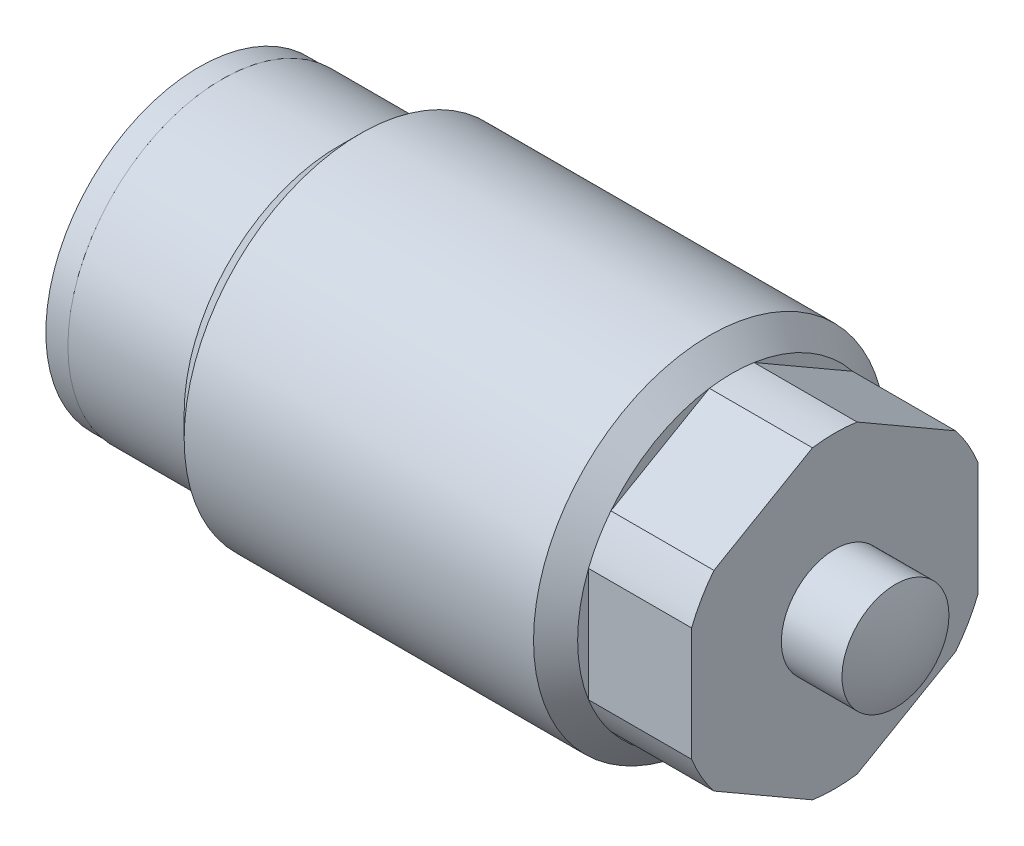
ISO-10303-21;
HEADER;
FILE_DESCRIPTION(('STEP AP214'),'2;1');
FILE_NAME('part.step','',(''),(''),'','','');
FILE_SCHEMA(('AUTOMOTIVE_DESIGN { 1 0 10303 214 1 1 1 1 }'));
ENDSEC;
DATA;
#1=APPLICATION_CONTEXT('core data for automotive mechanical design processes');
#2=APPLICATION_PROTOCOL_DEFINITION('international standard','automotive_design',2000,#1);
#3=PRODUCT_CONTEXT('',#1,'mechanical');
#4=PRODUCT('Part','Part','',(#3));
#5=PRODUCT_RELATED_PRODUCT_CATEGORY('part','',(#4));
#6=PRODUCT_DEFINITION_FORMATION('','',#4);
#7=PRODUCT_DEFINITION_CONTEXT('part definition',#1,'design');
#8=PRODUCT_DEFINITION('design','',#6,#7);
#9=PRODUCT_DEFINITION_SHAPE('','',#8);
#10=(LENGTH_UNIT() NAMED_UNIT(*) SI_UNIT(.MILLI.,.METRE.));
#11=(NAMED_UNIT(*) PLANE_ANGLE_UNIT() SI_UNIT($,.RADIAN.));
#12=(NAMED_UNIT(*) SI_UNIT($,.STERADIAN.) SOLID_ANGLE_UNIT());
#13=UNCERTAINTY_MEASURE_WITH_UNIT(LENGTH_MEASURE(1.E-05),#10,'distance_accuracy_value','');
#14=(GEOMETRIC_REPRESENTATION_CONTEXT(3) GLOBAL_UNCERTAINTY_ASSIGNED_CONTEXT((#13)) GLOBAL_UNIT_ASSIGNED_CONTEXT((#10,
#11,#12)) REPRESENTATION_CONTEXT('',''));
#15=CARTESIAN_POINT('',(0.,0.,0.));
#16=DIRECTION('',(0.,0.,1.));
#17=DIRECTION('',(1.,0.,0.));
#18=AXIS2_PLACEMENT_3D('',#15,#16,#17);
#19=CARTESIAN_POINT('',(22.606,7.8105,0.));
#20=DIRECTION('',(1.,0.,0.));
#21=DIRECTION('',(0.,0.,-1.));
#22=AXIS2_PLACEMENT_3D('',#19,#20,#21);
#23=PLANE('',#22);
#24=DIRECTION('',(0.,-0.5,-0.866025403784439));
#25=VECTOR('',#24,1.);
#26=CARTESIAN_POINT('',(22.606,-3.66617420935412,6.35));
#27=LINE('',#26,#25);
#28=CARTESIAN_POINT('',(22.606,-4.23811870115982,5.35936308108337));
#29=VERTEX_POINT('',#28);
#30=CARTESIAN_POINT('',(22.606,-6.76040392690255,0.990636918916635));
#31=VERTEX_POINT('',#30);
#32=EDGE_CURVE('E196',#29,#31,#27,.T.);
#33=ORIENTED_EDGE('',*,*,#32,.F.);
#34=CARTESIAN_POINT('',(22.606,0.,0.));
#35=DIRECTION('',(1.,0.,0.));
#36=DIRECTION('',(0.,0.,-1.));
#37=AXIS2_PLACEMENT_3D('',#34,#35,#36);
#38=CIRCLE('',#37,6.8326);
#39=EDGE_CURVE('E12',#29,#31,#38,.T.);
#40=ORIENTED_EDGE('',*,*,#39,.T.);
#41=EDGE_LOOP('',(#33,#40));
#42=FACE_BOUND('',#41,.T.);
#43=ADVANCED_FACE('F41',(#42),#23,.T.);
#44=DIRECTION('',(0.,0.5,-0.866025403784439));
#45=VECTOR('',#44,1.);
#46=CARTESIAN_POINT('',(22.606,-7.33234841870825,0.));
#47=LINE('',#46,#45);
#48=CARTESIAN_POINT('',(22.606,-6.76040392690255,-0.990636918916635));
#49=VERTEX_POINT('',#48);
#50=CARTESIAN_POINT('',(22.606,-4.23811870115983,-5.35936308108337));
#51=VERTEX_POINT('',#50);
#52=EDGE_CURVE('E194',#49,#51,#47,.T.);
#53=ORIENTED_EDGE('',*,*,#52,.F.);
#54=CARTESIAN_POINT('',(22.606,0.,0.));
#55=DIRECTION('',(1.,0.,0.));
#56=DIRECTION('',(0.,0.,-1.));
#57=AXIS2_PLACEMENT_3D('',#54,#55,#56);
#58=CIRCLE('',#57,6.8326);
#59=EDGE_CURVE('E49',#49,#51,#58,.T.);
#60=ORIENTED_EDGE('',*,*,#59,.T.);
#61=EDGE_LOOP('',(#53,#60));
#62=FACE_BOUND('',#61,.T.);
#63=ADVANCED_FACE('F271',(#62),#23,.T.);
#64=DIRECTION('',(0.,1.,0.));
#65=VECTOR('',#64,1.);
#66=CARTESIAN_POINT('',(22.606,-3.66617420935412,-6.35));
#67=LINE('',#66,#65);
#68=CARTESIAN_POINT('',(22.606,-2.52228522574272,-6.35));
#69=VERTEX_POINT('',#68);
#70=CARTESIAN_POINT('',(22.606,2.52228522574272,-6.35));
#71=VERTEX_POINT('',#70);
#72=EDGE_CURVE('E150',#69,#71,#67,.T.);
#73=ORIENTED_EDGE('',*,*,#72,.F.);
#74=CARTESIAN_POINT('',(22.606,0.,0.));
#75=DIRECTION('',(1.,0.,0.));
#76=DIRECTION('',(0.,0.,-1.));
#77=AXIS2_PLACEMENT_3D('',#74,#75,#76);
#78=CIRCLE('',#77,6.8326);
#79=EDGE_CURVE('E159',#69,#71,#78,.T.);
#80=ORIENTED_EDGE('',*,*,#79,.T.);
#81=EDGE_LOOP('',(#73,#80));
#82=FACE_BOUND('',#81,.T.);
#83=ADVANCED_FACE('F158',(#82),#23,.T.);
#84=DIRECTION('',(0.,0.5,0.866025403784439));
#85=VECTOR('',#84,1.);
#86=CARTESIAN_POINT('',(22.606,3.66617420935412,-6.35));
#87=LINE('',#86,#85);
#88=CARTESIAN_POINT('',(22.606,4.23811870115983,-5.35936308108337));
#89=VERTEX_POINT('',#88);
#90=CARTESIAN_POINT('',(22.606,6.76040392690255,-0.990636918916637));
#91=VERTEX_POINT('',#90);
#92=EDGE_CURVE('E161',#89,#91,#87,.T.);
#93=ORIENTED_EDGE('',*,*,#92,.F.);
#94=CARTESIAN_POINT('',(22.606,0.,0.));
#95=DIRECTION('',(1.,0.,0.));
#96=DIRECTION('',(0.,0.,-1.));
#97=AXIS2_PLACEMENT_3D('',#94,#95,#96);
#98=CIRCLE('',#97,6.8326);
#99=EDGE_CURVE('E166',#89,#91,#98,.T.);
#100=ORIENTED_EDGE('',*,*,#99,.T.);
#101=EDGE_LOOP('',(#93,#100));
#102=FACE_BOUND('',#101,.T.);
#103=ADVANCED_FACE('F278',(#102),#23,.T.);
#104=DIRECTION('',(0.,-0.5,0.866025403784439));
#105=VECTOR('',#104,1.);
#106=CARTESIAN_POINT('',(22.606,7.33234841870825,0.));
#107=LINE('',#106,#105);
#108=CARTESIAN_POINT('',(22.606,6.76040392690255,0.99063691891664));
#109=VERTEX_POINT('',#108);
#110=CARTESIAN_POINT('',(22.606,4.23811870115983,5.35936308108336));
#111=VERTEX_POINT('',#110);
#112=EDGE_CURVE('E202',#109,#111,#107,.T.);
#113=ORIENTED_EDGE('',*,*,#112,.F.);
#114=CARTESIAN_POINT('',(22.606,0.,0.));
#115=DIRECTION('',(1.,0.,0.));
#116=DIRECTION('',(0.,0.,-1.));
#117=AXIS2_PLACEMENT_3D('',#114,#115,#116);
#118=CIRCLE('',#117,6.8326);
#119=EDGE_CURVE('E168',#109,#111,#118,.T.);
#120=ORIENTED_EDGE('',*,*,#119,.T.);
#121=EDGE_LOOP('',(#113,#120));
#122=FACE_BOUND('',#121,.T.);
#123=ADVANCED_FACE('F286',(#122),#23,.T.);
#124=CARTESIAN_POINT('',(27.178,-3.66617420935412,-6.35));
#125=DIRECTION('',(0.,0.,1.));
#126=DIRECTION('',(1.,0.,0.));
#127=AXIS2_PLACEMENT_3D('',#124,#125,#126);
#128=PLANE('',#127);
#129=DIRECTION('',(1.,0.,0.));
#130=VECTOR('',#129,1.);
#131=CARTESIAN_POINT('',(0.51456994216988,-2.52228522574272,-6.35));
#132=LINE('',#131,#130);
#133=CARTESIAN_POINT('',(27.178,-2.52228522574272,-6.35));
#134=VERTEX_POINT('',#133);
#135=EDGE_CURVE('E133',#69,#134,#132,.T.);
#136=ORIENTED_EDGE('',*,*,#135,.F.);
#137=ORIENTED_EDGE('',*,*,#72,.T.);
#138=DIRECTION('',(1.,0.,0.));
#139=VECTOR('',#138,1.);
#140=CARTESIAN_POINT('',(0.51456994216988,2.52228522574272,-6.35));
#141=LINE('',#140,#139);
#142=CARTESIAN_POINT('',(27.178,2.52228522574272,-6.35));
#143=VERTEX_POINT('',#142);
#144=EDGE_CURVE('E155',#143,#71,#141,.F.);
#145=ORIENTED_EDGE('',*,*,#144,.F.);
#146=DIRECTION('',(0.,1.,0.));
#147=VECTOR('',#146,1.);
#148=CARTESIAN_POINT('',(27.178,-3.66617420935412,-6.35));
#149=LINE('',#148,#147);
#150=EDGE_CURVE('E153',#134,#143,#149,.T.);
#151=ORIENTED_EDGE('',*,*,#150,.F.);
#152=EDGE_LOOP('',(#136,#137,#145,#151));
#153=FACE_BOUND('',#152,.T.);
#154=ADVANCED_FACE('F148',(#153),#128,.F.);
#155=CARTESIAN_POINT('',(27.178,3.66617420935412,-6.35));
#156=DIRECTION('',(0.,-0.866025403784438,0.5));
#157=DIRECTION('',(0.,-0.5,-0.866025403784439));
#158=AXIS2_PLACEMENT_3D('',#155,#156,#157);
#159=PLANE('',#158);
#160=DIRECTION('',(1.,0.,0.));
#161=VECTOR('',#160,1.);
#162=CARTESIAN_POINT('',(0.51456994216988,4.23811870115982,-5.35936308108337));
#163=LINE('',#162,#161);
#164=CARTESIAN_POINT('',(27.178,4.23811870115982,-5.35936308108337));
#165=VERTEX_POINT('',#164);
#166=EDGE_CURVE('E230',#89,#165,#163,.T.);
#167=ORIENTED_EDGE('',*,*,#166,.F.);
#168=ORIENTED_EDGE('',*,*,#92,.T.);
#169=DIRECTION('',(1.,0.,0.));
#170=VECTOR('',#169,1.);
#171=CARTESIAN_POINT('',(0.51456994216988,6.76040392690255,-0.990636918916636));
#172=LINE('',#171,#170);
#173=CARTESIAN_POINT('',(27.178,6.76040392690255,-0.990636918916636));
#174=VERTEX_POINT('',#173);
#175=EDGE_CURVE('E232',#174,#91,#172,.F.);
#176=ORIENTED_EDGE('',*,*,#175,.F.);
#177=DIRECTION('',(0.,0.5,0.866025403784439));
#178=VECTOR('',#177,1.);
#179=CARTESIAN_POINT('',(27.178,3.66617420935412,-6.35));
#180=LINE('',#179,#178);
#181=EDGE_CURVE('E218',#165,#174,#180,.T.);
#182=ORIENTED_EDGE('',*,*,#181,.F.);
#183=EDGE_LOOP('',(#167,#168,#176,#182));
#184=FACE_BOUND('',#183,.T.);
#185=ADVANCED_FACE('F316',(#184),#159,.F.);
#186=CARTESIAN_POINT('',(27.178,7.33234841870825,0.));
#187=DIRECTION('',(0.,-0.866025403784439,-0.5));
#188=DIRECTION('',(0.,0.5,-0.866025403784439));
#189=AXIS2_PLACEMENT_3D('',#186,#187,#188);
#190=PLANE('',#189);
#191=DIRECTION('',(1.,0.,0.));
#192=VECTOR('',#191,1.);
#193=CARTESIAN_POINT('',(0.51456994216988,6.76040392690255,0.990636918916643));
#194=LINE('',#193,#192);
#195=CARTESIAN_POINT('',(27.178,6.76040392690255,0.990636918916636));
#196=VERTEX_POINT('',#195);
#197=EDGE_CURVE('E235',#109,#196,#194,.T.);
#198=ORIENTED_EDGE('',*,*,#197,.F.);
#199=ORIENTED_EDGE('',*,*,#112,.T.);
#200=DIRECTION('',(1.,0.,0.));
#201=VECTOR('',#200,1.);
#202=CARTESIAN_POINT('',(0.51456994216988,4.23811870115983,5.35936308108336));
#203=LINE('',#202,#201);
#204=CARTESIAN_POINT('',(27.178,4.23811870115983,5.35936308108336));
#205=VERTEX_POINT('',#204);
#206=EDGE_CURVE('E237',#205,#111,#203,.F.);
#207=ORIENTED_EDGE('',*,*,#206,.F.);
#208=DIRECTION('',(0.,-0.5,0.866025403784439));
#209=VECTOR('',#208,1.);
#210=CARTESIAN_POINT('',(27.178,7.33234841870825,0.));
#211=LINE('',#210,#209);
#212=EDGE_CURVE('E215',#196,#205,#211,.T.);
#213=ORIENTED_EDGE('',*,*,#212,.F.);
#214=EDGE_LOOP('',(#198,#199,#207,#213));
#215=FACE_BOUND('',#214,.T.);
#216=ADVANCED_FACE('F319',(#215),#190,.F.);
#217=CARTESIAN_POINT('',(27.178,3.66617420935413,6.35));
#218=DIRECTION('',(0.,0.,-1.));
#219=DIRECTION('',(-1.,0.,0.));
#220=AXIS2_PLACEMENT_3D('',#217,#218,#219);
#221=PLANE('',#220);
#222=DIRECTION('',(1.,0.,0.));
#223=VECTOR('',#222,1.);
#224=CARTESIAN_POINT('',(0.51456994216988,2.52228522574272,6.35));
#225=LINE('',#224,#223);
#226=CARTESIAN_POINT('',(22.606,2.52228522574272,6.35));
#227=VERTEX_POINT('',#226);
#228=CARTESIAN_POINT('',(27.178,2.52228522574272,6.35));
#229=VERTEX_POINT('',#228);
#230=EDGE_CURVE('E240',#227,#229,#225,.T.);
#231=ORIENTED_EDGE('',*,*,#230,.F.);
#232=DIRECTION('',(0.,-1.,0.));
#233=VECTOR('',#232,1.);
#234=CARTESIAN_POINT('',(22.606,3.66617420935413,6.35));
#235=LINE('',#234,#233);
#236=CARTESIAN_POINT('',(22.606,-2.52228522574272,6.35));
#237=VERTEX_POINT('',#236);
#238=EDGE_CURVE('E199',#227,#237,#235,.T.);
#239=ORIENTED_EDGE('',*,*,#238,.T.);
#240=DIRECTION('',(1.,0.,0.));
#241=VECTOR('',#240,1.);
#242=CARTESIAN_POINT('',(0.51456994216988,-2.52228522574272,6.35));
#243=LINE('',#242,#241);
#244=CARTESIAN_POINT('',(27.178,-2.52228522574272,6.35));
#245=VERTEX_POINT('',#244);
#246=EDGE_CURVE('E242',#245,#237,#243,.F.);
#247=ORIENTED_EDGE('',*,*,#246,.F.);
#248=DIRECTION('',(0.,-1.,0.));
#249=VECTOR('',#248,1.);
#250=CARTESIAN_POINT('',(27.178,3.66617420935413,6.35));
#251=LINE('',#250,#249);
#252=EDGE_CURVE('E212',#229,#245,#251,.T.);
#253=ORIENTED_EDGE('',*,*,#252,.F.);
#254=EDGE_LOOP('',(#231,#239,#247,#253));
#255=FACE_BOUND('',#254,.T.);
#256=ADVANCED_FACE('F323',(#255),#221,.F.);
#257=CARTESIAN_POINT('',(27.178,-3.66617420935412,6.35));
#258=DIRECTION('',(0.,0.866025403784439,-0.5));
#259=DIRECTION('',(0.,0.5,0.866025403784439));
#260=AXIS2_PLACEMENT_3D('',#257,#258,#259);
#261=PLANE('',#260);
#262=DIRECTION('',(1.,0.,0.));
#263=VECTOR('',#262,1.);
#264=CARTESIAN_POINT('',(0.51456994216988,-4.23811870115983,5.35936308108336));
#265=LINE('',#264,#263);
#266=CARTESIAN_POINT('',(27.178,-4.23811870115982,5.35936308108337));
#267=VERTEX_POINT('',#266);
#268=EDGE_CURVE('E64',#29,#267,#265,.T.);
#269=ORIENTED_EDGE('',*,*,#268,.F.);
#270=ORIENTED_EDGE('',*,*,#32,.T.);
#271=DIRECTION('',(1.,0.,0.));
#272=VECTOR('',#271,1.);
#273=CARTESIAN_POINT('',(0.51456994216988,-6.76040392690255,0.990636918916641));
#274=LINE('',#273,#272);
#275=CARTESIAN_POINT('',(27.178,-6.76040392690255,0.990636918916635));
#276=VERTEX_POINT('',#275);
#277=EDGE_CURVE('E246',#276,#31,#274,.F.);
#278=ORIENTED_EDGE('',*,*,#277,.F.);
#279=DIRECTION('',(0.,-0.5,-0.866025403784439));
#280=VECTOR('',#279,1.);
#281=CARTESIAN_POINT('',(27.178,-3.66617420935412,6.35));
#282=LINE('',#281,#280);
#283=EDGE_CURVE('E209',#267,#276,#282,.T.);
#284=ORIENTED_EDGE('',*,*,#283,.F.);
#285=EDGE_LOOP('',(#269,#270,#278,#284));
#286=FACE_BOUND('',#285,.T.);
#287=ADVANCED_FACE('F327',(#286),#261,.F.);
#288=CARTESIAN_POINT('',(27.178,-7.33234841870825,0.));
#289=DIRECTION('',(0.,0.866025403784439,0.5));
#290=DIRECTION('',(0.,-0.5,0.866025403784439));
#291=AXIS2_PLACEMENT_3D('',#288,#289,#290);
#292=PLANE('',#291);
#293=DIRECTION('',(1.,0.,0.));
#294=VECTOR('',#293,1.);
#295=CARTESIAN_POINT('',(0.51456994216988,-6.76040392690255,-0.990636918916637));
#296=LINE('',#295,#294);
#297=CARTESIAN_POINT('',(27.178,-6.76040392690255,-0.99063691891663));
#298=VERTEX_POINT('',#297);
#299=EDGE_CURVE('E56',#49,#298,#296,.T.);
#300=ORIENTED_EDGE('',*,*,#299,.F.);
#301=ORIENTED_EDGE('',*,*,#52,.T.);
#302=DIRECTION('',(1.,0.,0.));
#303=VECTOR('',#302,1.);
#304=CARTESIAN_POINT('',(0.51456994216988,-4.23811870115983,-5.35936308108336));
#305=LINE('',#304,#303);
#306=CARTESIAN_POINT('',(27.178,-4.23811870115982,-5.35936308108337));
#307=VERTEX_POINT('',#306);
#308=EDGE_CURVE('E136',#307,#51,#305,.F.);
#309=ORIENTED_EDGE('',*,*,#308,.F.);
#310=DIRECTION('',(0.,0.5,-0.866025403784439));
#311=VECTOR('',#310,1.);
#312=CARTESIAN_POINT('',(27.178,-7.33234841870825,0.));
#313=LINE('',#312,#311);
#314=EDGE_CURVE('E193',#298,#307,#313,.T.);
#315=ORIENTED_EDGE('',*,*,#314,.F.);
#316=EDGE_LOOP('',(#300,#301,#309,#315));
#317=FACE_BOUND('',#316,.T.);
#318=ADVANCED_FACE('F269',(#317),#292,.F.);
#319=CARTESIAN_POINT('',(27.178,10.9985226280624,-6.35));
#320=DIRECTION('',(1.,0.,0.));
#321=DIRECTION('',(0.,0.,-1.));
#322=AXIS2_PLACEMENT_3D('',#319,#320,#321);
#323=PLANE('',#322);
#324=CARTESIAN_POINT('',(27.178,0.,0.));
#325=DIRECTION('',(1.,0.,0.));
#326=DIRECTION('',(0.,0.,-1.));
#327=AXIS2_PLACEMENT_3D('',#324,#325,#326);
#328=CIRCLE('',#327,2.37109);
#329=CARTESIAN_POINT('',(27.178,0.,-2.37109));
#330=VERTEX_POINT('',#329);
#331=EDGE_CURVE('E181',#330,#330,#328,.T.);
#332=ORIENTED_EDGE('',*,*,#331,.F.);
#333=EDGE_LOOP('',(#332));
#334=FACE_BOUND('',#333,.T.);
#335=ORIENTED_EDGE('',*,*,#150,.T.);
#336=CARTESIAN_POINT('',(27.178,0.,0.));
#337=DIRECTION('',(1.,0.,0.));
#338=DIRECTION('',(0.,0.,-1.));
#339=AXIS2_PLACEMENT_3D('',#336,#337,#338);
#340=CIRCLE('',#339,6.8326);
#341=EDGE_CURVE('E251',#143,#165,#340,.T.);
#342=ORIENTED_EDGE('',*,*,#341,.T.);
#343=ORIENTED_EDGE('',*,*,#181,.T.);
#344=CARTESIAN_POINT('',(27.178,0.,0.));
#345=DIRECTION('',(1.,0.,0.));
#346=DIRECTION('',(0.,0.,-1.));
#347=AXIS2_PLACEMENT_3D('',#344,#345,#346);
#348=CIRCLE('',#347,6.8326);
#349=EDGE_CURVE('E177',#174,#196,#348,.T.);
#350=ORIENTED_EDGE('',*,*,#349,.T.);
#351=ORIENTED_EDGE('',*,*,#212,.T.);
#352=EDGE_CURVE('E370',#205,#229,#348,.T.);
#353=ORIENTED_EDGE('',*,*,#352,.T.);
#354=ORIENTED_EDGE('',*,*,#252,.T.);
#355=EDGE_CURVE('E369',#245,#267,#348,.T.);
#356=ORIENTED_EDGE('',*,*,#355,.T.);
#357=ORIENTED_EDGE('',*,*,#283,.T.);
#358=EDGE_CURVE('E180',#276,#298,#348,.T.);
#359=ORIENTED_EDGE('',*,*,#358,.T.);
#360=ORIENTED_EDGE('',*,*,#314,.T.);
#361=EDGE_CURVE('E178',#307,#134,#348,.T.);
#362=ORIENTED_EDGE('',*,*,#361,.T.);
#363=EDGE_LOOP('',(#335,#342,#343,#350,#351,#353,#354,#356,#357,#359,#360,#362));
#364=FACE_BOUND('',#363,.T.);
#365=ADVANCED_FACE('F284',(#334,#364),#323,.T.);
#366=ORIENTED_EDGE('',*,*,#238,.F.);
#367=CARTESIAN_POINT('',(22.606,0.,0.));
#368=DIRECTION('',(1.,0.,0.));
#369=DIRECTION('',(0.,0.,-1.));
#370=AXIS2_PLACEMENT_3D('',#367,#368,#369);
#371=CIRCLE('',#370,6.8326);
#372=EDGE_CURVE('E172',#227,#237,#371,.T.);
#373=ORIENTED_EDGE('',*,*,#372,.T.);
#374=EDGE_LOOP('',(#366,#373));
#375=FACE_BOUND('',#374,.T.);
#376=ADVANCED_FACE('F280',(#375),#23,.T.);
#377=CARTESIAN_POINT('',(30.6025425410263,0.,0.));
#378=DIRECTION('',(-1.,0.,0.));
#379=DIRECTION('',(0.,0.,1.));
#380=AXIS2_PLACEMENT_3D('',#377,#378,#379);
#381=CYLINDRICAL_SURFACE('',#380,7.8105);
#382=CARTESIAN_POINT('',(21.6281,0.,0.));
#383=DIRECTION('',(1.,0.,0.));
#384=DIRECTION('',(0.,0.,-1.));
#385=AXIS2_PLACEMENT_3D('',#382,#383,#384);
#386=CIRCLE('',#385,7.8105);
#387=CARTESIAN_POINT('',(21.6281,0.,-7.8105));
#388=VERTEX_POINT('',#387);
#389=EDGE_CURVE('E174',#388,#388,#386,.F.);
#390=ORIENTED_EDGE('',*,*,#389,.T.);
#391=EDGE_LOOP('',(#390));
#392=FACE_BOUND('',#391,.T.);
#393=CARTESIAN_POINT('',(6.13409999999999,0.,0.));
#394=DIRECTION('',(-1.,0.,0.));
#395=DIRECTION('',(0.,0.,1.));
#396=AXIS2_PLACEMENT_3D('',#393,#394,#395);
#397=CIRCLE('',#396,7.8105);
#398=CARTESIAN_POINT('',(6.13409999999999,0.,7.8105));
#399=VERTEX_POINT('',#398);
#400=EDGE_CURVE('E190',#399,#399,#397,.T.);
#401=ORIENTED_EDGE('',*,*,#400,.F.);
#402=EDGE_LOOP('',(#401));
#403=FACE_BOUND('',#402,.T.);
#404=ADVANCED_FACE('F283',(#392,#403),#381,.T.);
#405=CARTESIAN_POINT('',(0.,0.,0.));
#406=DIRECTION('',(-1.,0.,0.));
#407=DIRECTION('',(0.,0.,1.));
#408=AXIS2_PLACEMENT_3D('',#405,#406,#407);
#409=PLANE('',#408);
#410=CARTESIAN_POINT('',(0.,0.,0.));
#411=DIRECTION('',(-1.,0.,0.));
#412=DIRECTION('',(0.,0.,1.));
#413=AXIS2_PLACEMENT_3D('',#410,#411,#412);
#414=CIRCLE('',#413,2.78130000000001);
#415=CARTESIAN_POINT('',(0.,0.,2.78130000000001));
#416=VERTEX_POINT('',#415);
#417=EDGE_CURVE('E154',#416,#416,#414,.T.);
#418=ORIENTED_EDGE('',*,*,#417,.F.);
#419=EDGE_LOOP('',(#418));
#420=FACE_BOUND('',#419,.T.);
#421=CARTESIAN_POINT('',(0.,0.,0.));
#422=DIRECTION('',(-1.,0.,0.));
#423=DIRECTION('',(0.,0.,1.));
#424=AXIS2_PLACEMENT_3D('',#421,#422,#423);
#425=CIRCLE('',#424,6.8326);
#426=CARTESIAN_POINT('',(0.,0.,6.8326));
#427=VERTEX_POINT('',#426);
#428=EDGE_CURVE('E184',#427,#427,#425,.T.);
#429=ORIENTED_EDGE('',*,*,#428,.T.);
#430=EDGE_LOOP('',(#429));
#431=FACE_BOUND('',#430,.T.);
#432=ADVANCED_FACE('F287',(#420,#431),#409,.T.);
#433=CARTESIAN_POINT('',(30.6025425410263,0.,0.));
#434=DIRECTION('',(-1.,0.,0.));
#435=DIRECTION('',(0.,0.,1.));
#436=AXIS2_PLACEMENT_3D('',#433,#434,#435);
#437=CYLINDRICAL_SURFACE('',#436,6.8326);
#438=CARTESIAN_POINT('',(5.1562,0.,0.));
#439=DIRECTION('',(-1.,0.,0.));
#440=DIRECTION('',(0.,0.,1.));
#441=AXIS2_PLACEMENT_3D('',#438,#439,#440);
#442=CIRCLE('',#441,6.8326);
#443=CARTESIAN_POINT('',(5.1562,0.,6.8326));
#444=VERTEX_POINT('',#443);
#445=EDGE_CURVE('E187',#444,#444,#442,.T.);
#446=ORIENTED_EDGE('',*,*,#445,.T.);
#447=EDGE_LOOP('',(#446));
#448=FACE_BOUND('',#447,.T.);
#449=ORIENTED_EDGE('',*,*,#428,.F.);
#450=EDGE_LOOP('',(#449));
#451=FACE_BOUND('',#450,.T.);
#452=ADVANCED_FACE('F294',(#448,#451),#437,.T.);
#453=CARTESIAN_POINT('',(5.1562,0.,0.));
#454=DIRECTION('',(1.,0.,0.));
#455=DIRECTION('',(0.,0.,-1.));
#456=AXIS2_PLACEMENT_3D('',#453,#454,#455);
#457=CONICAL_SURFACE('',#456,6.8326,0.785398163397453);
#458=ORIENTED_EDGE('',*,*,#400,.T.);
#459=EDGE_LOOP('',(#458));
#460=FACE_BOUND('',#459,.T.);
#461=ORIENTED_EDGE('',*,*,#445,.F.);
#462=EDGE_LOOP('',(#461));
#463=FACE_BOUND('',#462,.T.);
#464=ADVANCED_FACE('F300',(#460,#463),#457,.T.);
#465=CARTESIAN_POINT('',(27.178,0.,0.));
#466=DIRECTION('',(1.,0.,0.));
#467=DIRECTION('',(0.,0.,-1.));
#468=AXIS2_PLACEMENT_3D('',#465,#466,#467);
#469=CYLINDRICAL_SURFACE('',#468,2.37109);
#470=ORIENTED_EDGE('',*,*,#331,.T.);
#471=EDGE_LOOP('',(#470));
#472=FACE_BOUND('',#471,.T.);
#473=CARTESIAN_POINT('',(29.8683072760323,0.,0.));
#474=DIRECTION('',(1.,0.,0.));
#475=DIRECTION('',(0.,0.,-1.));
#476=AXIS2_PLACEMENT_3D('',#473,#474,#475);
#477=CIRCLE('',#476,2.37109);
#478=CARTESIAN_POINT('',(29.8683072760323,0.,-2.37109));
#479=VERTEX_POINT('',#478);
#480=EDGE_CURVE('E162',#479,#479,#477,.T.);
#481=ORIENTED_EDGE('',*,*,#480,.F.);
#482=EDGE_LOOP('',(#481));
#483=FACE_BOUND('',#482,.T.);
#484=ADVANCED_FACE('F303',(#472,#483),#469,.T.);
#485=CARTESIAN_POINT('',(23.9776,0.,0.));
#486=DIRECTION('',(1.,0.,0.));
#487=DIRECTION('',(0.,-1.,0.));
#488=AXIS2_PLACEMENT_3D('',#485,#486,#487);
#489=SPHERICAL_SURFACE('',#488,6.35);
#490=ORIENTED_EDGE('',*,*,#480,.T.);
#491=EDGE_LOOP('',(#490));
#492=FACE_BOUND('',#491,.T.);
#493=ADVANCED_FACE('F339',(#492),#489,.T.);
#494=CARTESIAN_POINT('',(1.143,0.,0.));
#495=DIRECTION('',(1.,0.,0.));
#496=DIRECTION('',(0.,0.,-1.));
#497=AXIS2_PLACEMENT_3D('',#494,#495,#496);
#498=PLANE('',#497);
#499=CARTESIAN_POINT('',(1.143,0.,0.));
#500=DIRECTION('',(-1.,0.,0.));
#501=DIRECTION('',(0.,0.,1.));
#502=AXIS2_PLACEMENT_3D('',#499,#500,#501);
#503=CIRCLE('',#502,2.78130000000001);
#504=CARTESIAN_POINT('',(1.143,0.,2.78130000000001));
#505=VERTEX_POINT('',#504);
#506=EDGE_CURVE('E224',#505,#505,#503,.T.);
#507=ORIENTED_EDGE('',*,*,#506,.T.);
#508=EDGE_LOOP('',(#507));
#509=FACE_BOUND('',#508,.T.);
#510=ADVANCED_FACE('F343',(#509),#498,.F.);
#511=CARTESIAN_POINT('',(0.,0.,0.));
#512=DIRECTION('',(-1.,0.,0.));
#513=DIRECTION('',(0.,0.,1.));
#514=AXIS2_PLACEMENT_3D('',#511,#512,#513);
#515=CYLINDRICAL_SURFACE('',#514,2.78130000000001);
#516=ORIENTED_EDGE('',*,*,#506,.F.);
#517=EDGE_LOOP('',(#516));
#518=FACE_BOUND('',#517,.T.);
#519=ORIENTED_EDGE('',*,*,#417,.T.);
#520=EDGE_LOOP('',(#519));
#521=FACE_BOUND('',#520,.T.);
#522=ADVANCED_FACE('F347',(#518,#521),#515,.F.);
#523=CARTESIAN_POINT('',(0.51456994216988,0.,0.));
#524=DIRECTION('',(1.,0.,0.));
#525=DIRECTION('',(0.,0.,-1.));
#526=AXIS2_PLACEMENT_3D('',#523,#524,#525);
#527=CYLINDRICAL_SURFACE('',#526,6.8326);
#528=ORIENTED_EDGE('',*,*,#135,.T.);
#529=ORIENTED_EDGE('',*,*,#361,.F.);
#530=ORIENTED_EDGE('',*,*,#308,.T.);
#531=CARTESIAN_POINT('',(22.606,0.,0.));
#532=DIRECTION('',(1.,0.,0.));
#533=DIRECTION('',(0.,0.,-1.));
#534=AXIS2_PLACEMENT_3D('',#531,#532,#533);
#535=CIRCLE('',#534,6.8326);
#536=EDGE_CURVE('E130',#69,#51,#535,.F.);
#537=ORIENTED_EDGE('',*,*,#536,.F.);
#538=EDGE_LOOP('',(#528,#529,#530,#537));
#539=FACE_BOUND('',#538,.T.);
#540=ADVANCED_FACE('F132',(#539),#527,.T.);
#541=ORIENTED_EDGE('',*,*,#277,.T.);
#542=EDGE_CURVE('E141',#49,#31,#535,.F.);
#543=ORIENTED_EDGE('',*,*,#542,.F.);
#544=ORIENTED_EDGE('',*,*,#299,.T.);
#545=ORIENTED_EDGE('',*,*,#358,.F.);
#546=EDGE_LOOP('',(#541,#543,#544,#545));
#547=FACE_BOUND('',#546,.T.);
#548=ADVANCED_FACE('F264',(#547),#527,.T.);
#549=ORIENTED_EDGE('',*,*,#246,.T.);
#550=EDGE_CURVE('E260',#29,#237,#535,.F.);
#551=ORIENTED_EDGE('',*,*,#550,.F.);
#552=ORIENTED_EDGE('',*,*,#268,.T.);
#553=ORIENTED_EDGE('',*,*,#355,.F.);
#554=EDGE_LOOP('',(#549,#551,#552,#553));
#555=FACE_BOUND('',#554,.T.);
#556=ADVANCED_FACE('F357',(#555),#527,.T.);
#557=ORIENTED_EDGE('',*,*,#206,.T.);
#558=EDGE_CURVE('E257',#227,#111,#535,.F.);
#559=ORIENTED_EDGE('',*,*,#558,.F.);
#560=ORIENTED_EDGE('',*,*,#230,.T.);
#561=ORIENTED_EDGE('',*,*,#352,.F.);
#562=EDGE_LOOP('',(#557,#559,#560,#561));
#563=FACE_BOUND('',#562,.T.);
#564=ADVANCED_FACE('F365',(#563),#527,.T.);
#565=ORIENTED_EDGE('',*,*,#175,.T.);
#566=EDGE_CURVE('E255',#109,#91,#535,.F.);
#567=ORIENTED_EDGE('',*,*,#566,.F.);
#568=ORIENTED_EDGE('',*,*,#197,.T.);
#569=ORIENTED_EDGE('',*,*,#349,.F.);
#570=EDGE_LOOP('',(#565,#567,#568,#569));
#571=FACE_BOUND('',#570,.T.);
#572=ADVANCED_FACE('F359',(#571),#527,.T.);
#573=ORIENTED_EDGE('',*,*,#144,.T.);
#574=EDGE_CURVE('E143',#89,#71,#535,.F.);
#575=ORIENTED_EDGE('',*,*,#574,.F.);
#576=ORIENTED_EDGE('',*,*,#166,.T.);
#577=ORIENTED_EDGE('',*,*,#341,.F.);
#578=EDGE_LOOP('',(#573,#575,#576,#577));
#579=FACE_BOUND('',#578,.T.);
#580=ADVANCED_FACE('F353',(#579),#527,.T.);
#581=CARTESIAN_POINT('',(21.6281,0.,0.));
#582=DIRECTION('',(-1.,0.,0.));
#583=DIRECTION('',(0.,0.,1.));
#584=AXIS2_PLACEMENT_3D('',#581,#582,#583);
#585=CONICAL_SURFACE('',#584,7.8105,0.785398163397451);
#586=ORIENTED_EDGE('',*,*,#39,.F.);
#587=ORIENTED_EDGE('',*,*,#550,.T.);
#588=ORIENTED_EDGE('',*,*,#372,.F.);
#589=ORIENTED_EDGE('',*,*,#558,.T.);
#590=ORIENTED_EDGE('',*,*,#119,.F.);
#591=ORIENTED_EDGE('',*,*,#566,.T.);
#592=ORIENTED_EDGE('',*,*,#99,.F.);
#593=ORIENTED_EDGE('',*,*,#574,.T.);
#594=ORIENTED_EDGE('',*,*,#79,.F.);
#595=ORIENTED_EDGE('',*,*,#536,.T.);
#596=ORIENTED_EDGE('',*,*,#59,.F.);
#597=ORIENTED_EDGE('',*,*,#542,.T.);
#598=EDGE_LOOP('',(#586,#587,#588,#589,#590,#591,#592,#593,#594,#595,#596,#597));
#599=FACE_BOUND('',#598,.T.);
#600=ORIENTED_EDGE('',*,*,#389,.F.);
#601=EDGE_LOOP('',(#600));
#602=FACE_BOUND('',#601,.T.);
#603=ADVANCED_FACE('F43',(#599,#602),#585,.T.);
#604=CLOSED_SHELL('',(#43,#63,#83,#103,#123,#154,#185,#216,#256,#287,#318,#365,#376,#404,#432,
#452,#464,#484,#493,#510,#522,#540,#548,#556,#564,#572,#580,#603));
#605=MANIFOLD_SOLID_BREP('B2',#604);
#606=CARTESIAN_POINT('',(-0.0254000000000024,4.9657,0.));
#607=DIRECTION('',(1.,0.,0.));
#608=DIRECTION('',(0.,0.,-1.));
#609=AXIS2_PLACEMENT_3D('',#606,#607,#608);
#610=PLANE('',#609);
#611=CARTESIAN_POINT('',(-0.0254000000000028,0.,0.));
#612=DIRECTION('',(1.,0.,0.));
#613=DIRECTION('',(0.,0.,-1.));
#614=AXIS2_PLACEMENT_3D('',#611,#612,#613);
#615=CIRCLE('',#614,6.7945);
#616=CARTESIAN_POINT('',(-0.0254000000000028,0.,-6.7945));
#617=VERTEX_POINT('',#616);
#618=EDGE_CURVE('E40',#617,#617,#615,.T.);
#619=ORIENTED_EDGE('',*,*,#618,.T.);
#620=EDGE_LOOP('',(#619));
#621=FACE_BOUND('',#620,.T.);
#622=CARTESIAN_POINT('',(-0.025400000000002,0.,0.));
#623=DIRECTION('',(1.,0.,0.));
#624=DIRECTION('',(0.,0.,-1.));
#625=AXIS2_PLACEMENT_3D('',#622,#623,#624);
#626=CIRCLE('',#625,4.9657);
#627=CARTESIAN_POINT('',(-0.025400000000002,0.,-4.9657));
#628=VERTEX_POINT('',#627);
#629=EDGE_CURVE('E590',#628,#628,#626,.T.);
#630=ORIENTED_EDGE('',*,*,#629,.F.);
#631=EDGE_LOOP('',(#630));
#632=FACE_BOUND('',#631,.T.);
#633=ADVANCED_FACE('F576',(#621,#632),#610,.T.);
#634=CARTESIAN_POINT('',(-0.762,0.,0.));
#635=DIRECTION('',(1.,0.,0.));
#636=DIRECTION('',(0.,0.,-1.));
#637=AXIS2_PLACEMENT_3D('',#634,#635,#636);
#638=CYLINDRICAL_SURFACE('',#637,6.7945);
#639=CARTESIAN_POINT('',(-1.016,0.,0.));
#640=DIRECTION('',(1.,0.,0.));
#641=DIRECTION('',(0.,0.,-1.));
#642=AXIS2_PLACEMENT_3D('',#639,#640,#641);
#643=CIRCLE('',#642,6.7945);
#644=CARTESIAN_POINT('',(-1.016,0.,-6.7945));
#645=VERTEX_POINT('',#644);
#646=EDGE_CURVE('E582',#645,#645,#643,.T.);
#647=ORIENTED_EDGE('',*,*,#646,.T.);
#648=EDGE_LOOP('',(#647));
#649=FACE_BOUND('',#648,.T.);
#650=ORIENTED_EDGE('',*,*,#618,.F.);
#651=EDGE_LOOP('',(#650));
#652=FACE_BOUND('',#651,.T.);
#653=ADVANCED_FACE('F600',(#649,#652),#638,.T.);
#654=CARTESIAN_POINT('',(-1.016,6.7945,0.));
#655=DIRECTION('',(-1.,0.,0.));
#656=DIRECTION('',(0.,0.,1.));
#657=AXIS2_PLACEMENT_3D('',#654,#655,#656);
#658=PLANE('',#657);
#659=CARTESIAN_POINT('',(-1.016,0.,0.));
#660=DIRECTION('',(1.,0.,0.));
#661=DIRECTION('',(0.,0.,-1.));
#662=AXIS2_PLACEMENT_3D('',#659,#660,#661);
#663=CIRCLE('',#662,4.9657);
#664=CARTESIAN_POINT('',(-1.016,0.,-4.9657));
#665=VERTEX_POINT('',#664);
#666=EDGE_CURVE('E586',#665,#665,#663,.T.);
#667=ORIENTED_EDGE('',*,*,#666,.T.);
#668=EDGE_LOOP('',(#667));
#669=FACE_BOUND('',#668,.T.);
#670=ORIENTED_EDGE('',*,*,#646,.F.);
#671=EDGE_LOOP('',(#670));
#672=FACE_BOUND('',#671,.T.);
#673=ADVANCED_FACE('F604',(#669,#672),#658,.T.);
#674=CARTESIAN_POINT('',(-0.762,0.,0.));
#675=DIRECTION('',(1.,0.,0.));
#676=DIRECTION('',(0.,0.,-1.));
#677=AXIS2_PLACEMENT_3D('',#674,#675,#676);
#678=CYLINDRICAL_SURFACE('',#677,4.9657);
#679=ORIENTED_EDGE('',*,*,#629,.T.);
#680=EDGE_LOOP('',(#679));
#681=FACE_BOUND('',#680,.T.);
#682=ORIENTED_EDGE('',*,*,#666,.F.);
#683=EDGE_LOOP('',(#682));
#684=FACE_BOUND('',#683,.T.);
#685=ADVANCED_FACE('F596',(#681,#684),#678,.F.);
#686=CLOSED_SHELL('',(#633,#653,#673,#685));
#687=MANIFOLD_SOLID_BREP('B6',#686);
#688=ADVANCED_BREP_SHAPE_REPRESENTATION('',(#18,#605,#687),#14);
#689=SHAPE_DEFINITION_REPRESENTATION(#9,#688);
ENDSEC;
END-ISO-10303-21;
